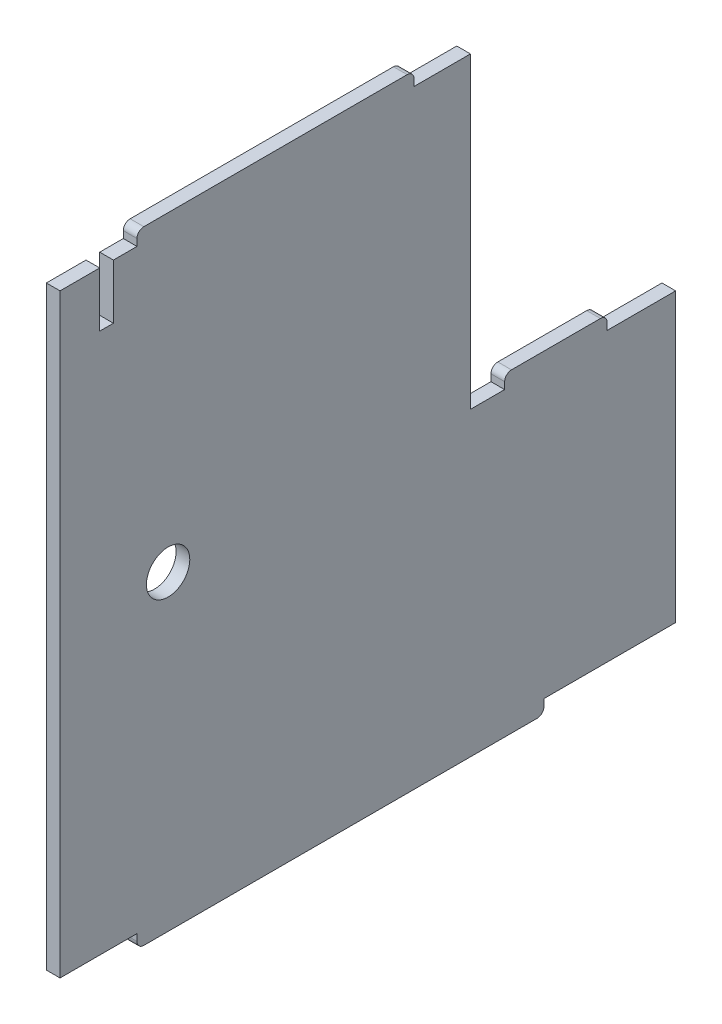
ISO-10303-21;
HEADER;
FILE_DESCRIPTION(('STEP AP214'),'2;1');
FILE_NAME('part.step','',(''),(''),'','','');
FILE_SCHEMA(('AUTOMOTIVE_DESIGN { 1 0 10303 214 1 1 1 1 }'));
ENDSEC;
DATA;
#1=APPLICATION_CONTEXT('core data for automotive mechanical design processes');
#2=APPLICATION_PROTOCOL_DEFINITION('international standard','automotive_design',2000,#1);
#3=PRODUCT_CONTEXT('',#1,'mechanical');
#4=PRODUCT('Part','Part','',(#3));
#5=PRODUCT_RELATED_PRODUCT_CATEGORY('part','',(#4));
#6=PRODUCT_DEFINITION_FORMATION('','',#4);
#7=PRODUCT_DEFINITION_CONTEXT('part definition',#1,'design');
#8=PRODUCT_DEFINITION('design','',#6,#7);
#9=PRODUCT_DEFINITION_SHAPE('','',#8);
#10=(LENGTH_UNIT() NAMED_UNIT(*) SI_UNIT(.MILLI.,.METRE.));
#11=(NAMED_UNIT(*) PLANE_ANGLE_UNIT() SI_UNIT($,.RADIAN.));
#12=(NAMED_UNIT(*) SI_UNIT($,.STERADIAN.) SOLID_ANGLE_UNIT());
#13=UNCERTAINTY_MEASURE_WITH_UNIT(LENGTH_MEASURE(1.E-05),#10,'distance_accuracy_value','');
#14=(GEOMETRIC_REPRESENTATION_CONTEXT(3) GLOBAL_UNCERTAINTY_ASSIGNED_CONTEXT((#13)) GLOBAL_UNIT_ASSIGNED_CONTEXT((#10,
#11,#12)) REPRESENTATION_CONTEXT('',''));
#15=CARTESIAN_POINT('',(0.,0.,0.));
#16=DIRECTION('',(0.,0.,1.));
#17=DIRECTION('',(1.,0.,0.));
#18=AXIS2_PLACEMENT_3D('',#15,#16,#17);
#19=CARTESIAN_POINT('',(2.,-21.2437855155228,-20.7523835906544));
#20=DIRECTION('',(-1.,0.,0.));
#21=DIRECTION('',(0.,0.,1.));
#22=AXIS2_PLACEMENT_3D('',#19,#20,#21);
#23=PLANE('',#22);
#24=DIRECTION('',(0.,0.,1.));
#25=VECTOR('',#24,1.);
#26=CARTESIAN_POINT('',(2.,22.7562144844773,-6.50187471929071));
#27=LINE('',#26,#25);
#28=CARTESIAN_POINT('',(2.,22.7562144844773,-14.7523835906544));
#29=VERTEX_POINT('',#28);
#30=CARTESIAN_POINT('',(2.,22.7562144844773,-6.50187471929071));
#31=VERTEX_POINT('',#30);
#32=EDGE_CURVE('E303',#29,#31,#27,.T.);
#33=ORIENTED_EDGE('',*,*,#32,.T.);
#34=DIRECTION('',(0.,1.,0.));
#35=VECTOR('',#34,1.);
#36=CARTESIAN_POINT('',(2.,22.7562144844773,-6.50187471929071));
#37=LINE('',#36,#35);
#38=CARTESIAN_POINT('',(2.,23.7562144844773,-6.50187471929071));
#39=VERTEX_POINT('',#38);
#40=EDGE_CURVE('E151',#31,#39,#37,.T.);
#41=ORIENTED_EDGE('',*,*,#40,.T.);
#42=CARTESIAN_POINT('',(2.,23.7562144844773,-5.50187471929071));
#43=DIRECTION('',(1.,0.,0.));
#44=DIRECTION('',(0.,0.,-1.));
#45=AXIS2_PLACEMENT_3D('',#42,#43,#44);
#46=CIRCLE('',#45,1.);
#47=CARTESIAN_POINT('',(2.,24.7562144844773,-5.5018747192907));
#48=VERTEX_POINT('',#47);
#49=EDGE_CURVE('E378',#39,#48,#46,.T.);
#50=ORIENTED_EDGE('',*,*,#49,.T.);
#51=DIRECTION('',(0.,0.,1.));
#52=VECTOR('',#51,1.);
#53=CARTESIAN_POINT('',(2.,24.7562144844773,-5.5018747192907));
#54=LINE('',#53,#52);
#55=CARTESIAN_POINT('',(2.,24.7562144844773,32.9971075379794));
#56=VERTEX_POINT('',#55);
#57=EDGE_CURVE('E397',#48,#56,#54,.T.);
#58=ORIENTED_EDGE('',*,*,#57,.T.);
#59=CARTESIAN_POINT('',(2.,23.7562144844773,32.9971075379794));
#60=DIRECTION('',(1.,0.,0.));
#61=DIRECTION('',(0.,0.,1.));
#62=AXIS2_PLACEMENT_3D('',#59,#60,#61);
#63=CIRCLE('',#62,1.);
#64=CARTESIAN_POINT('',(2.,23.7562144844773,33.9971075379794));
#65=VERTEX_POINT('',#64);
#66=EDGE_CURVE('E394',#56,#65,#63,.T.);
#67=ORIENTED_EDGE('',*,*,#66,.T.);
#68=DIRECTION('',(0.,-1.,0.));
#69=VECTOR('',#68,1.);
#70=CARTESIAN_POINT('',(2.,22.7562144844773,33.9971075379794));
#71=LINE('',#70,#69);
#72=CARTESIAN_POINT('',(2.,22.7562144844773,33.9971075379794));
#73=VERTEX_POINT('',#72);
#74=EDGE_CURVE('E396',#65,#73,#71,.T.);
#75=ORIENTED_EDGE('',*,*,#74,.T.);
#76=DIRECTION('',(0.,0.,1.));
#77=VECTOR('',#76,1.);
#78=CARTESIAN_POINT('',(2.,22.7562144844773,37.4476164093443));
#79=LINE('',#78,#77);
#80=CARTESIAN_POINT('',(2.,22.7562144844773,37.4476164093443));
#81=VERTEX_POINT('',#80);
#82=EDGE_CURVE('E399',#73,#81,#79,.T.);
#83=ORIENTED_EDGE('',*,*,#82,.T.);
#84=DIRECTION('',(0.,-1.,0.));
#85=VECTOR('',#84,1.);
#86=CARTESIAN_POINT('',(2.,14.7562144844773,37.4476164093443));
#87=LINE('',#86,#85);
#88=CARTESIAN_POINT('',(2.,14.7562144844773,37.4476164093443));
#89=VERTEX_POINT('',#88);
#90=EDGE_CURVE('E405',#81,#89,#87,.T.);
#91=ORIENTED_EDGE('',*,*,#90,.T.);
#92=DIRECTION('',(0.,0.,1.));
#93=VECTOR('',#92,1.);
#94=CARTESIAN_POINT('',(2.,14.7562144844773,37.4476164093443));
#95=LINE('',#94,#93);
#96=CARTESIAN_POINT('',(2.,14.7562144844773,39.4476164093443));
#97=VERTEX_POINT('',#96);
#98=EDGE_CURVE('E407',#89,#97,#95,.T.);
#99=ORIENTED_EDGE('',*,*,#98,.T.);
#100=DIRECTION('',(0.,1.,0.));
#101=VECTOR('',#100,1.);
#102=CARTESIAN_POINT('',(2.,14.7562144844773,39.4476164093443));
#103=LINE('',#102,#101);
#104=CARTESIAN_POINT('',(2.,22.7562144844773,39.4476164093443));
#105=VERTEX_POINT('',#104);
#106=EDGE_CURVE('E409',#97,#105,#103,.T.);
#107=ORIENTED_EDGE('',*,*,#106,.T.);
#108=DIRECTION('',(0.,0.,1.));
#109=VECTOR('',#108,1.);
#110=CARTESIAN_POINT('',(2.,22.7562144844773,39.4476164093443));
#111=LINE('',#110,#109);
#112=CARTESIAN_POINT('',(2.,22.7562144844773,45.2476164093441));
#113=VERTEX_POINT('',#112);
#114=EDGE_CURVE('E411',#105,#113,#111,.T.);
#115=ORIENTED_EDGE('',*,*,#114,.T.);
#116=DIRECTION('',(0.,-1.,0.));
#117=VECTOR('',#116,1.);
#118=CARTESIAN_POINT('',(2.,-64.2437855155227,45.2476164093441));
#119=LINE('',#118,#117);
#120=CARTESIAN_POINT('',(2.,-64.2437855155227,45.2476164093441));
#121=VERTEX_POINT('',#120);
#122=EDGE_CURVE('E413',#113,#121,#119,.T.);
#123=ORIENTED_EDGE('',*,*,#122,.T.);
#124=DIRECTION('',(0.,0.,-1.));
#125=VECTOR('',#124,1.);
#126=CARTESIAN_POINT('',(2.,-64.2437855155227,45.2476164093441));
#127=LINE('',#126,#125);
#128=CARTESIAN_POINT('',(2.,-64.2437855155227,33.9971075379816));
#129=VERTEX_POINT('',#128);
#130=EDGE_CURVE('E415',#121,#129,#127,.T.);
#131=ORIENTED_EDGE('',*,*,#130,.T.);
#132=DIRECTION('',(0.,-1.,0.));
#133=VECTOR('',#132,1.);
#134=CARTESIAN_POINT('',(2.,-64.2437855155227,33.9971075379816));
#135=LINE('',#134,#133);
#136=CARTESIAN_POINT('',(2.,-65.2437855155227,33.9971075379817));
#137=VERTEX_POINT('',#136);
#138=EDGE_CURVE('E417',#129,#137,#135,.T.);
#139=ORIENTED_EDGE('',*,*,#138,.T.);
#140=CARTESIAN_POINT('',(2.,-65.2437855155227,32.9971075379818));
#141=DIRECTION('',(1.,0.,0.));
#142=DIRECTION('',(0.,0.,1.));
#143=AXIS2_PLACEMENT_3D('',#140,#141,#142);
#144=CIRCLE('',#143,0.999999999999911);
#145=CARTESIAN_POINT('',(2.,-66.2437855155227,32.9971075379816));
#146=VERTEX_POINT('',#145);
#147=EDGE_CURVE('E419',#137,#146,#144,.T.);
#148=ORIENTED_EDGE('',*,*,#147,.T.);
#149=DIRECTION('',(0.,0.,-1.));
#150=VECTOR('',#149,1.);
#151=CARTESIAN_POINT('',(2.,-66.2437855155227,32.9971075379816));
#152=LINE('',#151,#150);
#153=CARTESIAN_POINT('',(2.,-66.2437855155227,-24.5018747192884));
#154=VERTEX_POINT('',#153);
#155=EDGE_CURVE('E421',#146,#154,#152,.T.);
#156=ORIENTED_EDGE('',*,*,#155,.T.);
#157=CARTESIAN_POINT('',(2.,-65.2437855155227,-24.5018747192884));
#158=DIRECTION('',(1.,0.,0.));
#159=DIRECTION('',(0.,0.,-1.));
#160=AXIS2_PLACEMENT_3D('',#157,#158,#159);
#161=CIRCLE('',#160,1.00000000000002);
#162=CARTESIAN_POINT('',(2.,-65.2437855155227,-25.5018747192884));
#163=VERTEX_POINT('',#162);
#164=EDGE_CURVE('E423',#154,#163,#161,.T.);
#165=ORIENTED_EDGE('',*,*,#164,.T.);
#166=DIRECTION('',(0.,1.,0.));
#167=VECTOR('',#166,1.);
#168=CARTESIAN_POINT('',(2.,-64.2437855155228,-25.5018747192884));
#169=LINE('',#168,#167);
#170=CARTESIAN_POINT('',(2.,-64.2437855155228,-25.5018747192884));
#171=VERTEX_POINT('',#170);
#172=EDGE_CURVE('E425',#163,#171,#169,.T.);
#173=ORIENTED_EDGE('',*,*,#172,.T.);
#174=DIRECTION('',(0.,0.,-1.));
#175=VECTOR('',#174,1.);
#176=CARTESIAN_POINT('',(2.,-64.2437855155228,-44.7523835906534));
#177=LINE('',#176,#175);
#178=CARTESIAN_POINT('',(2.,-64.2437855155228,-44.7523835906534));
#179=VERTEX_POINT('',#178);
#180=EDGE_CURVE('E427',#171,#179,#177,.T.);
#181=ORIENTED_EDGE('',*,*,#180,.T.);
#182=DIRECTION('',(0.,1.,0.));
#183=VECTOR('',#182,1.);
#184=CARTESIAN_POINT('',(2.,-64.2437855155228,-44.7523835906534));
#185=LINE('',#184,#183);
#186=CARTESIAN_POINT('',(2.,-22.2437855155228,-44.7523835906533));
#187=VERTEX_POINT('',#186);
#188=EDGE_CURVE('E429',#179,#187,#185,.T.);
#189=ORIENTED_EDGE('',*,*,#188,.T.);
#190=DIRECTION('',(0.,0.,1.));
#191=VECTOR('',#190,1.);
#192=CARTESIAN_POINT('',(2.,-22.2437855155228,-44.7523835906533));
#193=LINE('',#192,#191);
#194=CARTESIAN_POINT('',(2.,-22.2437855155228,-34.7523835906544));
#195=VERTEX_POINT('',#194);
#196=EDGE_CURVE('E431',#187,#195,#193,.T.);
#197=ORIENTED_EDGE('',*,*,#196,.T.);
#198=DIRECTION('',(0.,1.,0.));
#199=VECTOR('',#198,1.);
#200=CARTESIAN_POINT('',(2.,-22.2437855155228,-34.7523835906544));
#201=LINE('',#200,#199);
#202=CARTESIAN_POINT('',(2.,-21.2437855155228,-34.7523835906544));
#203=VERTEX_POINT('',#202);
#204=EDGE_CURVE('E433',#195,#203,#201,.T.);
#205=ORIENTED_EDGE('',*,*,#204,.T.);
#206=CARTESIAN_POINT('',(2.,-21.2437855155228,-33.7523835906544));
#207=DIRECTION('',(1.,0.,0.));
#208=DIRECTION('',(0.,0.,-1.));
#209=AXIS2_PLACEMENT_3D('',#206,#207,#208);
#210=CIRCLE('',#209,1.);
#211=CARTESIAN_POINT('',(2.,-20.2437855155228,-33.7523835906544));
#212=VERTEX_POINT('',#211);
#213=EDGE_CURVE('E435',#203,#212,#210,.T.);
#214=ORIENTED_EDGE('',*,*,#213,.T.);
#215=DIRECTION('',(0.,0.,1.));
#216=VECTOR('',#215,1.);
#217=CARTESIAN_POINT('',(2.,-20.2437855155228,-33.7523835906544));
#218=LINE('',#217,#216);
#219=CARTESIAN_POINT('',(2.,-20.2437855155228,-20.7523835906544));
#220=VERTEX_POINT('',#219);
#221=EDGE_CURVE('E437',#212,#220,#218,.T.);
#222=ORIENTED_EDGE('',*,*,#221,.T.);
#223=CARTESIAN_POINT('',(2.,-21.2437855155228,-20.7523835906544));
#224=DIRECTION('',(1.,0.,0.));
#225=DIRECTION('',(0.,0.,1.));
#226=AXIS2_PLACEMENT_3D('',#223,#224,#225);
#227=CIRCLE('',#226,1.);
#228=CARTESIAN_POINT('',(2.,-21.2437855155228,-19.7523835906544));
#229=VERTEX_POINT('',#228);
#230=EDGE_CURVE('E230',#220,#229,#227,.T.);
#231=ORIENTED_EDGE('',*,*,#230,.T.);
#232=DIRECTION('',(0.,-1.,0.));
#233=VECTOR('',#232,1.);
#234=CARTESIAN_POINT('',(2.,-22.2437855155228,-19.7523835906544));
#235=LINE('',#234,#233);
#236=CARTESIAN_POINT('',(2.,-22.2437855155228,-19.7523835906544));
#237=VERTEX_POINT('',#236);
#238=EDGE_CURVE('E224',#229,#237,#235,.T.);
#239=ORIENTED_EDGE('',*,*,#238,.T.);
#240=DIRECTION('',(0.,0.,1.));
#241=VECTOR('',#240,1.);
#242=CARTESIAN_POINT('',(2.,-22.2437855155228,-19.7523835906544));
#243=LINE('',#242,#241);
#244=CARTESIAN_POINT('',(2.,-22.2437855155228,-14.7523835906544));
#245=VERTEX_POINT('',#244);
#246=EDGE_CURVE('E228',#237,#245,#243,.T.);
#247=ORIENTED_EDGE('',*,*,#246,.T.);
#248=DIRECTION('',(0.,1.,0.));
#249=VECTOR('',#248,1.);
#250=CARTESIAN_POINT('',(2.,-22.2437855155228,-14.7523835906544));
#251=LINE('',#250,#249);
#252=EDGE_CURVE('E48',#245,#29,#251,.T.);
#253=ORIENTED_EDGE('',*,*,#252,.T.);
#254=EDGE_LOOP('',(#33,#41,#50,#58,#67,#75,#83,#91,#99,#107,#115,#123,#131,#139,#148,#156,#165,
#173,#181,#189,#197,#205,#214,#222,#231,#239,#247,#253));
#255=FACE_BOUND('',#254,.T.);
#256=CARTESIAN_POINT('',(2.,-20.7437855155227,29.4476164093443));
#257=DIRECTION('',(1.,0.,0.));
#258=DIRECTION('',(0.,0.,-1.));
#259=AXIS2_PLACEMENT_3D('',#256,#257,#258);
#260=CIRCLE('',#259,3.17);
#261=CARTESIAN_POINT('',(2.,-20.7437855155227,26.2776164093443));
#262=VERTEX_POINT('',#261);
#263=EDGE_CURVE('E252',#262,#262,#260,.T.);
#264=ORIENTED_EDGE('',*,*,#263,.F.);
#265=EDGE_LOOP('',(#264));
#266=FACE_BOUND('',#265,.T.);
#267=ADVANCED_FACE('F31',(#255,#266),#23,.F.);
#268=CARTESIAN_POINT('',(0.,-21.2437855155228,-20.7523835906544));
#269=DIRECTION('',(-1.,0.,0.));
#270=DIRECTION('',(0.,0.,1.));
#271=AXIS2_PLACEMENT_3D('',#268,#269,#270);
#272=PLANE('',#271);
#273=DIRECTION('',(0.,0.,1.));
#274=VECTOR('',#273,1.);
#275=CARTESIAN_POINT('',(0.,22.7562144844773,-6.50187471929071));
#276=LINE('',#275,#274);
#277=CARTESIAN_POINT('',(0.,22.7562144844773,-14.7523835906544));
#278=VERTEX_POINT('',#277);
#279=CARTESIAN_POINT('',(0.,22.7562144844773,-6.50187471929071));
#280=VERTEX_POINT('',#279);
#281=EDGE_CURVE('E248',#278,#280,#276,.T.);
#282=ORIENTED_EDGE('',*,*,#281,.F.);
#283=DIRECTION('',(0.,1.,0.));
#284=VECTOR('',#283,1.);
#285=CARTESIAN_POINT('',(0.,-22.2437855155228,-14.7523835906544));
#286=LINE('',#285,#284);
#287=CARTESIAN_POINT('',(0.,-22.2437855155228,-14.7523835906544));
#288=VERTEX_POINT('',#287);
#289=EDGE_CURVE('E143',#288,#278,#286,.T.);
#290=ORIENTED_EDGE('',*,*,#289,.F.);
#291=DIRECTION('',(0.,0.,1.));
#292=VECTOR('',#291,1.);
#293=CARTESIAN_POINT('',(0.,-22.2437855155228,-19.7523835906544));
#294=LINE('',#293,#292);
#295=CARTESIAN_POINT('',(0.,-22.2437855155228,-19.7523835906544));
#296=VERTEX_POINT('',#295);
#297=EDGE_CURVE('E137',#296,#288,#294,.T.);
#298=ORIENTED_EDGE('',*,*,#297,.F.);
#299=DIRECTION('',(0.,-1.,0.));
#300=VECTOR('',#299,1.);
#301=CARTESIAN_POINT('',(0.,-22.2437855155228,-19.7523835906544));
#302=LINE('',#301,#300);
#303=CARTESIAN_POINT('',(0.,-21.2437855155228,-19.7523835906544));
#304=VERTEX_POINT('',#303);
#305=EDGE_CURVE('E238',#304,#296,#302,.T.);
#306=ORIENTED_EDGE('',*,*,#305,.F.);
#307=CARTESIAN_POINT('',(0.,-21.2437855155228,-20.7523835906544));
#308=DIRECTION('',(1.,0.,0.));
#309=DIRECTION('',(0.,0.,1.));
#310=AXIS2_PLACEMENT_3D('',#307,#308,#309);
#311=CIRCLE('',#310,1.);
#312=CARTESIAN_POINT('',(0.,-20.2437855155228,-20.7523835906544));
#313=VERTEX_POINT('',#312);
#314=EDGE_CURVE('E298',#313,#304,#311,.T.);
#315=ORIENTED_EDGE('',*,*,#314,.F.);
#316=DIRECTION('',(0.,0.,1.));
#317=VECTOR('',#316,1.);
#318=CARTESIAN_POINT('',(0.,-20.2437855155228,-33.7523835906544));
#319=LINE('',#318,#317);
#320=CARTESIAN_POINT('',(0.,-20.2437855155228,-33.7523835906544));
#321=VERTEX_POINT('',#320);
#322=EDGE_CURVE('E296',#321,#313,#319,.T.);
#323=ORIENTED_EDGE('',*,*,#322,.F.);
#324=CARTESIAN_POINT('',(0.,-21.2437855155228,-33.7523835906544));
#325=DIRECTION('',(1.,0.,0.));
#326=DIRECTION('',(0.,0.,-1.));
#327=AXIS2_PLACEMENT_3D('',#324,#325,#326);
#328=CIRCLE('',#327,1.);
#329=CARTESIAN_POINT('',(0.,-21.2437855155228,-34.7523835906544));
#330=VERTEX_POINT('',#329);
#331=EDGE_CURVE('E294',#330,#321,#328,.T.);
#332=ORIENTED_EDGE('',*,*,#331,.F.);
#333=DIRECTION('',(0.,1.,0.));
#334=VECTOR('',#333,1.);
#335=CARTESIAN_POINT('',(0.,-22.2437855155228,-34.7523835906544));
#336=LINE('',#335,#334);
#337=CARTESIAN_POINT('',(0.,-22.2437855155228,-34.7523835906544));
#338=VERTEX_POINT('',#337);
#339=EDGE_CURVE('E292',#338,#330,#336,.T.);
#340=ORIENTED_EDGE('',*,*,#339,.F.);
#341=DIRECTION('',(0.,0.,1.));
#342=VECTOR('',#341,1.);
#343=CARTESIAN_POINT('',(0.,-22.2437855155228,-44.7523835906533));
#344=LINE('',#343,#342);
#345=CARTESIAN_POINT('',(0.,-22.2437855155228,-44.7523835906533));
#346=VERTEX_POINT('',#345);
#347=EDGE_CURVE('E290',#346,#338,#344,.T.);
#348=ORIENTED_EDGE('',*,*,#347,.F.);
#349=DIRECTION('',(0.,1.,0.));
#350=VECTOR('',#349,1.);
#351=CARTESIAN_POINT('',(0.,-64.2437855155228,-44.7523835906534));
#352=LINE('',#351,#350);
#353=CARTESIAN_POINT('',(0.,-64.2437855155228,-44.7523835906534));
#354=VERTEX_POINT('',#353);
#355=EDGE_CURVE('E288',#354,#346,#352,.T.);
#356=ORIENTED_EDGE('',*,*,#355,.F.);
#357=DIRECTION('',(0.,0.,-1.));
#358=VECTOR('',#357,1.);
#359=CARTESIAN_POINT('',(0.,-64.2437855155228,-44.7523835906534));
#360=LINE('',#359,#358);
#361=CARTESIAN_POINT('',(0.,-64.2437855155228,-25.5018747192884));
#362=VERTEX_POINT('',#361);
#363=EDGE_CURVE('E286',#362,#354,#360,.T.);
#364=ORIENTED_EDGE('',*,*,#363,.F.);
#365=DIRECTION('',(0.,1.,0.));
#366=VECTOR('',#365,1.);
#367=CARTESIAN_POINT('',(0.,-64.2437855155228,-25.5018747192884));
#368=LINE('',#367,#366);
#369=CARTESIAN_POINT('',(0.,-65.2437855155227,-25.5018747192884));
#370=VERTEX_POINT('',#369);
#371=EDGE_CURVE('E284',#370,#362,#368,.T.);
#372=ORIENTED_EDGE('',*,*,#371,.F.);
#373=CARTESIAN_POINT('',(0.,-65.2437855155227,-24.5018747192884));
#374=DIRECTION('',(1.,0.,0.));
#375=DIRECTION('',(0.,0.,-1.));
#376=AXIS2_PLACEMENT_3D('',#373,#374,#375);
#377=CIRCLE('',#376,1.00000000000002);
#378=CARTESIAN_POINT('',(0.,-66.2437855155227,-24.5018747192884));
#379=VERTEX_POINT('',#378);
#380=EDGE_CURVE('E282',#379,#370,#377,.T.);
#381=ORIENTED_EDGE('',*,*,#380,.F.);
#382=DIRECTION('',(0.,0.,-1.));
#383=VECTOR('',#382,1.);
#384=CARTESIAN_POINT('',(0.,-66.2437855155227,32.9971075379816));
#385=LINE('',#384,#383);
#386=CARTESIAN_POINT('',(0.,-66.2437855155227,32.9971075379816));
#387=VERTEX_POINT('',#386);
#388=EDGE_CURVE('E280',#387,#379,#385,.T.);
#389=ORIENTED_EDGE('',*,*,#388,.F.);
#390=CARTESIAN_POINT('',(0.,-65.2437855155227,32.9971075379818));
#391=DIRECTION('',(1.,0.,0.));
#392=DIRECTION('',(0.,0.,1.));
#393=AXIS2_PLACEMENT_3D('',#390,#391,#392);
#394=CIRCLE('',#393,0.999999999999911);
#395=CARTESIAN_POINT('',(0.,-65.2437855155227,33.9971075379817));
#396=VERTEX_POINT('',#395);
#397=EDGE_CURVE('E278',#396,#387,#394,.T.);
#398=ORIENTED_EDGE('',*,*,#397,.F.);
#399=DIRECTION('',(0.,-1.,0.));
#400=VECTOR('',#399,1.);
#401=CARTESIAN_POINT('',(0.,-64.2437855155227,33.9971075379816));
#402=LINE('',#401,#400);
#403=CARTESIAN_POINT('',(0.,-64.2437855155227,33.9971075379816));
#404=VERTEX_POINT('',#403);
#405=EDGE_CURVE('E276',#404,#396,#402,.T.);
#406=ORIENTED_EDGE('',*,*,#405,.F.);
#407=DIRECTION('',(0.,0.,-1.));
#408=VECTOR('',#407,1.);
#409=CARTESIAN_POINT('',(0.,-64.2437855155227,45.2476164093441));
#410=LINE('',#409,#408);
#411=CARTESIAN_POINT('',(0.,-64.2437855155227,45.2476164093441));
#412=VERTEX_POINT('',#411);
#413=EDGE_CURVE('E274',#412,#404,#410,.T.);
#414=ORIENTED_EDGE('',*,*,#413,.F.);
#415=DIRECTION('',(0.,-1.,0.));
#416=VECTOR('',#415,1.);
#417=CARTESIAN_POINT('',(0.,-64.2437855155227,45.2476164093441));
#418=LINE('',#417,#416);
#419=CARTESIAN_POINT('',(0.,22.7562144844773,45.2476164093441));
#420=VERTEX_POINT('',#419);
#421=EDGE_CURVE('E272',#420,#412,#418,.T.);
#422=ORIENTED_EDGE('',*,*,#421,.F.);
#423=DIRECTION('',(0.,0.,1.));
#424=VECTOR('',#423,1.);
#425=CARTESIAN_POINT('',(0.,22.7562144844773,39.4476164093443));
#426=LINE('',#425,#424);
#427=CARTESIAN_POINT('',(0.,22.7562144844773,39.4476164093443));
#428=VERTEX_POINT('',#427);
#429=EDGE_CURVE('E270',#428,#420,#426,.T.);
#430=ORIENTED_EDGE('',*,*,#429,.F.);
#431=DIRECTION('',(0.,1.,0.));
#432=VECTOR('',#431,1.);
#433=CARTESIAN_POINT('',(0.,14.7562144844773,39.4476164093443));
#434=LINE('',#433,#432);
#435=CARTESIAN_POINT('',(0.,14.7562144844773,39.4476164093443));
#436=VERTEX_POINT('',#435);
#437=EDGE_CURVE('E268',#436,#428,#434,.T.);
#438=ORIENTED_EDGE('',*,*,#437,.F.);
#439=DIRECTION('',(0.,0.,1.));
#440=VECTOR('',#439,1.);
#441=CARTESIAN_POINT('',(0.,14.7562144844773,37.4476164093443));
#442=LINE('',#441,#440);
#443=CARTESIAN_POINT('',(0.,14.7562144844773,37.4476164093443));
#444=VERTEX_POINT('',#443);
#445=EDGE_CURVE('E266',#444,#436,#442,.T.);
#446=ORIENTED_EDGE('',*,*,#445,.F.);
#447=DIRECTION('',(0.,-1.,0.));
#448=VECTOR('',#447,1.);
#449=CARTESIAN_POINT('',(0.,14.7562144844773,37.4476164093443));
#450=LINE('',#449,#448);
#451=CARTESIAN_POINT('',(0.,22.7562144844773,37.4476164093443));
#452=VERTEX_POINT('',#451);
#453=EDGE_CURVE('E264',#452,#444,#450,.T.);
#454=ORIENTED_EDGE('',*,*,#453,.F.);
#455=DIRECTION('',(0.,0.,1.));
#456=VECTOR('',#455,1.);
#457=CARTESIAN_POINT('',(0.,22.7562144844773,37.4476164093443));
#458=LINE('',#457,#456);
#459=CARTESIAN_POINT('',(0.,22.7562144844773,33.9971075379794));
#460=VERTEX_POINT('',#459);
#461=EDGE_CURVE('E262',#460,#452,#458,.T.);
#462=ORIENTED_EDGE('',*,*,#461,.F.);
#463=DIRECTION('',(0.,-1.,0.));
#464=VECTOR('',#463,1.);
#465=CARTESIAN_POINT('',(0.,22.7562144844773,33.9971075379794));
#466=LINE('',#465,#464);
#467=CARTESIAN_POINT('',(0.,23.7562144844773,33.9971075379794));
#468=VERTEX_POINT('',#467);
#469=EDGE_CURVE('E260',#468,#460,#466,.T.);
#470=ORIENTED_EDGE('',*,*,#469,.F.);
#471=CARTESIAN_POINT('',(0.,23.7562144844773,32.9971075379794));
#472=DIRECTION('',(1.,0.,0.));
#473=DIRECTION('',(0.,0.,1.));
#474=AXIS2_PLACEMENT_3D('',#471,#472,#473);
#475=CIRCLE('',#474,1.);
#476=CARTESIAN_POINT('',(0.,24.7562144844773,32.9971075379794));
#477=VERTEX_POINT('',#476);
#478=EDGE_CURVE('E258',#477,#468,#475,.T.);
#479=ORIENTED_EDGE('',*,*,#478,.F.);
#480=DIRECTION('',(0.,0.,1.));
#481=VECTOR('',#480,1.);
#482=CARTESIAN_POINT('',(0.,24.7562144844773,-5.5018747192907));
#483=LINE('',#482,#481);
#484=CARTESIAN_POINT('',(0.,24.7562144844773,-5.5018747192907));
#485=VERTEX_POINT('',#484);
#486=EDGE_CURVE('E256',#485,#477,#483,.T.);
#487=ORIENTED_EDGE('',*,*,#486,.F.);
#488=CARTESIAN_POINT('',(0.,23.7562144844773,-5.50187471929071));
#489=DIRECTION('',(1.,0.,0.));
#490=DIRECTION('',(0.,0.,-1.));
#491=AXIS2_PLACEMENT_3D('',#488,#489,#490);
#492=CIRCLE('',#491,1.);
#493=CARTESIAN_POINT('',(0.,23.7562144844773,-6.50187471929071));
#494=VERTEX_POINT('',#493);
#495=EDGE_CURVE('E254',#494,#485,#492,.T.);
#496=ORIENTED_EDGE('',*,*,#495,.F.);
#497=DIRECTION('',(0.,1.,0.));
#498=VECTOR('',#497,1.);
#499=CARTESIAN_POINT('',(0.,22.7562144844773,-6.50187471929071));
#500=LINE('',#499,#498);
#501=EDGE_CURVE('E251',#280,#494,#500,.T.);
#502=ORIENTED_EDGE('',*,*,#501,.F.);
#503=EDGE_LOOP('',(#282,#290,#298,#306,#315,#323,#332,#340,#348,#356,#364,#372,#381,#389,#398,
#406,#414,#422,#430,#438,#446,#454,#462,#470,#479,#487,#496,#502));
#504=FACE_BOUND('',#503,.T.);
#505=CARTESIAN_POINT('',(0.,-20.7437855155227,29.4476164093443));
#506=DIRECTION('',(1.,0.,0.));
#507=DIRECTION('',(0.,0.,-1.));
#508=AXIS2_PLACEMENT_3D('',#505,#506,#507);
#509=CIRCLE('',#508,3.17);
#510=CARTESIAN_POINT('',(0.,-20.7437855155227,26.2776164093443));
#511=VERTEX_POINT('',#510);
#512=EDGE_CURVE('E792',#511,#511,#509,.T.);
#513=ORIENTED_EDGE('',*,*,#512,.T.);
#514=EDGE_LOOP('',(#513));
#515=FACE_BOUND('',#514,.T.);
#516=ADVANCED_FACE('F382',(#504,#515),#272,.T.);
#517=CARTESIAN_POINT('',(2.,22.7562144844773,-6.50187471929071));
#518=DIRECTION('',(0.,-1.,0.));
#519=DIRECTION('',(0.,0.,-1.));
#520=AXIS2_PLACEMENT_3D('',#517,#518,#519);
#521=PLANE('',#520);
#522=ORIENTED_EDGE('',*,*,#281,.T.);
#523=DIRECTION('',(-1.,0.,0.));
#524=VECTOR('',#523,1.);
#525=CARTESIAN_POINT('',(2.,22.7562144844773,-6.50187471929071));
#526=LINE('',#525,#524);
#527=EDGE_CURVE('E11',#31,#280,#526,.T.);
#528=ORIENTED_EDGE('',*,*,#527,.F.);
#529=ORIENTED_EDGE('',*,*,#32,.F.);
#530=DIRECTION('',(-1.,0.,0.));
#531=VECTOR('',#530,1.);
#532=CARTESIAN_POINT('',(2.,22.7562144844773,-14.7523835906544));
#533=LINE('',#532,#531);
#534=EDGE_CURVE('E244',#29,#278,#533,.T.);
#535=ORIENTED_EDGE('',*,*,#534,.T.);
#536=EDGE_LOOP('',(#522,#528,#529,#535));
#537=FACE_BOUND('',#536,.T.);
#538=ADVANCED_FACE('F33',(#537),#521,.F.);
#539=CARTESIAN_POINT('',(2.,22.7562144844773,-6.50187471929071));
#540=DIRECTION('',(0.,0.,1.));
#541=DIRECTION('',(1.,0.,0.));
#542=AXIS2_PLACEMENT_3D('',#539,#540,#541);
#543=PLANE('',#542);
#544=ORIENTED_EDGE('',*,*,#501,.T.);
#545=DIRECTION('',(-1.,0.,0.));
#546=VECTOR('',#545,1.);
#547=CARTESIAN_POINT('',(2.,23.7562144844773,-6.50187471929071));
#548=LINE('',#547,#546);
#549=EDGE_CURVE('E40',#39,#494,#548,.T.);
#550=ORIENTED_EDGE('',*,*,#549,.F.);
#551=ORIENTED_EDGE('',*,*,#40,.F.);
#552=ORIENTED_EDGE('',*,*,#527,.T.);
#553=EDGE_LOOP('',(#544,#550,#551,#552));
#554=FACE_BOUND('',#553,.T.);
#555=ADVANCED_FACE('F471',(#554),#543,.F.);
#556=CARTESIAN_POINT('',(2.,23.7562144844773,-5.50187471929071));
#557=DIRECTION('',(-1.,0.,0.));
#558=DIRECTION('',(0.,0.,1.));
#559=AXIS2_PLACEMENT_3D('',#556,#557,#558);
#560=CYLINDRICAL_SURFACE('',#559,1.);
#561=ORIENTED_EDGE('',*,*,#495,.T.);
#562=DIRECTION('',(-1.,0.,0.));
#563=VECTOR('',#562,1.);
#564=CARTESIAN_POINT('',(2.,24.7562144844773,-5.5018747192907));
#565=LINE('',#564,#563);
#566=EDGE_CURVE('E370',#48,#485,#565,.T.);
#567=ORIENTED_EDGE('',*,*,#566,.F.);
#568=ORIENTED_EDGE('',*,*,#49,.F.);
#569=ORIENTED_EDGE('',*,*,#549,.T.);
#570=EDGE_LOOP('',(#561,#567,#568,#569));
#571=FACE_BOUND('',#570,.T.);
#572=ADVANCED_FACE('F376',(#571),#560,.T.);
#573=CARTESIAN_POINT('',(2.,24.7562144844773,-5.5018747192907));
#574=DIRECTION('',(0.,-1.,0.));
#575=DIRECTION('',(0.,0.,-1.));
#576=AXIS2_PLACEMENT_3D('',#573,#574,#575);
#577=PLANE('',#576);
#578=ORIENTED_EDGE('',*,*,#486,.T.);
#579=DIRECTION('',(-1.,0.,0.));
#580=VECTOR('',#579,1.);
#581=CARTESIAN_POINT('',(2.,24.7562144844773,32.9971075379794));
#582=LINE('',#581,#580);
#583=EDGE_CURVE('E367',#56,#477,#582,.T.);
#584=ORIENTED_EDGE('',*,*,#583,.F.);
#585=ORIENTED_EDGE('',*,*,#57,.F.);
#586=ORIENTED_EDGE('',*,*,#566,.T.);
#587=EDGE_LOOP('',(#578,#584,#585,#586));
#588=FACE_BOUND('',#587,.T.);
#589=ADVANCED_FACE('F388',(#588),#577,.F.);
#590=CARTESIAN_POINT('',(2.,23.7562144844773,32.9971075379794));
#591=DIRECTION('',(-1.,0.,0.));
#592=DIRECTION('',(0.,0.,1.));
#593=AXIS2_PLACEMENT_3D('',#590,#591,#592);
#594=CYLINDRICAL_SURFACE('',#593,1.);
#595=ORIENTED_EDGE('',*,*,#478,.T.);
#596=DIRECTION('',(-1.,0.,0.));
#597=VECTOR('',#596,1.);
#598=CARTESIAN_POINT('',(2.,23.7562144844773,33.9971075379794));
#599=LINE('',#598,#597);
#600=EDGE_CURVE('E364',#65,#468,#599,.T.);
#601=ORIENTED_EDGE('',*,*,#600,.F.);
#602=ORIENTED_EDGE('',*,*,#66,.F.);
#603=ORIENTED_EDGE('',*,*,#583,.T.);
#604=EDGE_LOOP('',(#595,#601,#602,#603));
#605=FACE_BOUND('',#604,.T.);
#606=ADVANCED_FACE('F392',(#605),#594,.T.);
#607=CARTESIAN_POINT('',(2.,22.7562144844773,33.9971075379794));
#608=DIRECTION('',(0.,0.,-1.));
#609=DIRECTION('',(-1.,0.,0.));
#610=AXIS2_PLACEMENT_3D('',#607,#608,#609);
#611=PLANE('',#610);
#612=ORIENTED_EDGE('',*,*,#469,.T.);
#613=DIRECTION('',(-1.,0.,0.));
#614=VECTOR('',#613,1.);
#615=CARTESIAN_POINT('',(2.,22.7562144844773,33.9971075379794));
#616=LINE('',#615,#614);
#617=EDGE_CURVE('E361',#73,#460,#616,.T.);
#618=ORIENTED_EDGE('',*,*,#617,.F.);
#619=ORIENTED_EDGE('',*,*,#74,.F.);
#620=ORIENTED_EDGE('',*,*,#600,.T.);
#621=EDGE_LOOP('',(#612,#618,#619,#620));
#622=FACE_BOUND('',#621,.T.);
#623=ADVANCED_FACE('F484',(#622),#611,.F.);
#624=CARTESIAN_POINT('',(2.,22.7562144844773,37.4476164093443));
#625=DIRECTION('',(0.,-1.,0.));
#626=DIRECTION('',(0.,0.,-1.));
#627=AXIS2_PLACEMENT_3D('',#624,#625,#626);
#628=PLANE('',#627);
#629=ORIENTED_EDGE('',*,*,#461,.T.);
#630=DIRECTION('',(-1.,0.,0.));
#631=VECTOR('',#630,1.);
#632=CARTESIAN_POINT('',(2.,22.7562144844773,37.4476164093443));
#633=LINE('',#632,#631);
#634=EDGE_CURVE('E358',#81,#452,#633,.T.);
#635=ORIENTED_EDGE('',*,*,#634,.F.);
#636=ORIENTED_EDGE('',*,*,#82,.F.);
#637=ORIENTED_EDGE('',*,*,#617,.T.);
#638=EDGE_LOOP('',(#629,#635,#636,#637));
#639=FACE_BOUND('',#638,.T.);
#640=ADVANCED_FACE('F487',(#639),#628,.F.);
#641=CARTESIAN_POINT('',(2.,14.7562144844773,37.4476164093443));
#642=DIRECTION('',(0.,0.,-1.));
#643=DIRECTION('',(-1.,0.,0.));
#644=AXIS2_PLACEMENT_3D('',#641,#642,#643);
#645=PLANE('',#644);
#646=ORIENTED_EDGE('',*,*,#453,.T.);
#647=DIRECTION('',(-1.,0.,0.));
#648=VECTOR('',#647,1.);
#649=CARTESIAN_POINT('',(2.,14.7562144844773,37.4476164093443));
#650=LINE('',#649,#648);
#651=EDGE_CURVE('E355',#89,#444,#650,.T.);
#652=ORIENTED_EDGE('',*,*,#651,.F.);
#653=ORIENTED_EDGE('',*,*,#90,.F.);
#654=ORIENTED_EDGE('',*,*,#634,.T.);
#655=EDGE_LOOP('',(#646,#652,#653,#654));
#656=FACE_BOUND('',#655,.T.);
#657=ADVANCED_FACE('F491',(#656),#645,.F.);
#658=CARTESIAN_POINT('',(2.,14.7562144844773,37.4476164093443));
#659=DIRECTION('',(0.,-1.,0.));
#660=DIRECTION('',(0.,0.,-1.));
#661=AXIS2_PLACEMENT_3D('',#658,#659,#660);
#662=PLANE('',#661);
#663=ORIENTED_EDGE('',*,*,#445,.T.);
#664=DIRECTION('',(-1.,0.,0.));
#665=VECTOR('',#664,1.);
#666=CARTESIAN_POINT('',(2.,14.7562144844773,39.4476164093443));
#667=LINE('',#666,#665);
#668=EDGE_CURVE('E352',#97,#436,#667,.T.);
#669=ORIENTED_EDGE('',*,*,#668,.F.);
#670=ORIENTED_EDGE('',*,*,#98,.F.);
#671=ORIENTED_EDGE('',*,*,#651,.T.);
#672=EDGE_LOOP('',(#663,#669,#670,#671));
#673=FACE_BOUND('',#672,.T.);
#674=ADVANCED_FACE('F495',(#673),#662,.F.);
#675=CARTESIAN_POINT('',(2.,14.7562144844773,39.4476164093443));
#676=DIRECTION('',(0.,0.,1.));
#677=DIRECTION('',(1.,0.,0.));
#678=AXIS2_PLACEMENT_3D('',#675,#676,#677);
#679=PLANE('',#678);
#680=ORIENTED_EDGE('',*,*,#437,.T.);
#681=DIRECTION('',(-1.,0.,0.));
#682=VECTOR('',#681,1.);
#683=CARTESIAN_POINT('',(2.,22.7562144844773,39.4476164093443));
#684=LINE('',#683,#682);
#685=EDGE_CURVE('E349',#105,#428,#684,.T.);
#686=ORIENTED_EDGE('',*,*,#685,.F.);
#687=ORIENTED_EDGE('',*,*,#106,.F.);
#688=ORIENTED_EDGE('',*,*,#668,.T.);
#689=EDGE_LOOP('',(#680,#686,#687,#688));
#690=FACE_BOUND('',#689,.T.);
#691=ADVANCED_FACE('F499',(#690),#679,.F.);
#692=CARTESIAN_POINT('',(2.,22.7562144844773,39.4476164093443));
#693=DIRECTION('',(0.,-1.,0.));
#694=DIRECTION('',(0.,0.,-1.));
#695=AXIS2_PLACEMENT_3D('',#692,#693,#694);
#696=PLANE('',#695);
#697=ORIENTED_EDGE('',*,*,#429,.T.);
#698=DIRECTION('',(-1.,0.,0.));
#699=VECTOR('',#698,1.);
#700=CARTESIAN_POINT('',(2.,22.7562144844773,45.2476164093441));
#701=LINE('',#700,#699);
#702=EDGE_CURVE('E346',#113,#420,#701,.T.);
#703=ORIENTED_EDGE('',*,*,#702,.F.);
#704=ORIENTED_EDGE('',*,*,#114,.F.);
#705=ORIENTED_EDGE('',*,*,#685,.T.);
#706=EDGE_LOOP('',(#697,#703,#704,#705));
#707=FACE_BOUND('',#706,.T.);
#708=ADVANCED_FACE('F503',(#707),#696,.F.);
#709=CARTESIAN_POINT('',(2.,-64.2437855155227,45.2476164093441));
#710=DIRECTION('',(0.,0.,-1.));
#711=DIRECTION('',(-1.,0.,0.));
#712=AXIS2_PLACEMENT_3D('',#709,#710,#711);
#713=PLANE('',#712);
#714=ORIENTED_EDGE('',*,*,#421,.T.);
#715=DIRECTION('',(-1.,0.,0.));
#716=VECTOR('',#715,1.);
#717=CARTESIAN_POINT('',(2.,-64.2437855155227,45.2476164093441));
#718=LINE('',#717,#716);
#719=EDGE_CURVE('E343',#121,#412,#718,.T.);
#720=ORIENTED_EDGE('',*,*,#719,.F.);
#721=ORIENTED_EDGE('',*,*,#122,.F.);
#722=ORIENTED_EDGE('',*,*,#702,.T.);
#723=EDGE_LOOP('',(#714,#720,#721,#722));
#724=FACE_BOUND('',#723,.T.);
#725=ADVANCED_FACE('F507',(#724),#713,.F.);
#726=CARTESIAN_POINT('',(2.,-64.2437855155227,45.2476164093441));
#727=DIRECTION('',(0.,1.,0.));
#728=DIRECTION('',(0.,0.,1.));
#729=AXIS2_PLACEMENT_3D('',#726,#727,#728);
#730=PLANE('',#729);
#731=ORIENTED_EDGE('',*,*,#413,.T.);
#732=DIRECTION('',(-1.,0.,0.));
#733=VECTOR('',#732,1.);
#734=CARTESIAN_POINT('',(2.,-64.2437855155227,33.9971075379816));
#735=LINE('',#734,#733);
#736=EDGE_CURVE('E340',#129,#404,#735,.T.);
#737=ORIENTED_EDGE('',*,*,#736,.F.);
#738=ORIENTED_EDGE('',*,*,#130,.F.);
#739=ORIENTED_EDGE('',*,*,#719,.T.);
#740=EDGE_LOOP('',(#731,#737,#738,#739));
#741=FACE_BOUND('',#740,.T.);
#742=ADVANCED_FACE('F511',(#741),#730,.F.);
#743=CARTESIAN_POINT('',(2.,-64.2437855155227,33.9971075379816));
#744=DIRECTION('',(0.,0.,-1.));
#745=DIRECTION('',(-1.,0.,0.));
#746=AXIS2_PLACEMENT_3D('',#743,#744,#745);
#747=PLANE('',#746);
#748=ORIENTED_EDGE('',*,*,#405,.T.);
#749=DIRECTION('',(-1.,0.,0.));
#750=VECTOR('',#749,1.);
#751=CARTESIAN_POINT('',(2.,-65.2437855155227,33.9971075379817));
#752=LINE('',#751,#750);
#753=EDGE_CURVE('E337',#137,#396,#752,.T.);
#754=ORIENTED_EDGE('',*,*,#753,.F.);
#755=ORIENTED_EDGE('',*,*,#138,.F.);
#756=ORIENTED_EDGE('',*,*,#736,.T.);
#757=EDGE_LOOP('',(#748,#754,#755,#756));
#758=FACE_BOUND('',#757,.T.);
#759=ADVANCED_FACE('F515',(#758),#747,.F.);
#760=CARTESIAN_POINT('',(2.,-65.2437855155227,32.9971075379818));
#761=DIRECTION('',(-1.,0.,0.));
#762=DIRECTION('',(0.,0.,1.));
#763=AXIS2_PLACEMENT_3D('',#760,#761,#762);
#764=CYLINDRICAL_SURFACE('',#763,0.999999999999911);
#765=ORIENTED_EDGE('',*,*,#397,.T.);
#766=DIRECTION('',(-1.,0.,0.));
#767=VECTOR('',#766,1.);
#768=CARTESIAN_POINT('',(2.,-66.2437855155227,32.9971075379816));
#769=LINE('',#768,#767);
#770=EDGE_CURVE('E334',#146,#387,#769,.T.);
#771=ORIENTED_EDGE('',*,*,#770,.F.);
#772=ORIENTED_EDGE('',*,*,#147,.F.);
#773=ORIENTED_EDGE('',*,*,#753,.T.);
#774=EDGE_LOOP('',(#765,#771,#772,#773));
#775=FACE_BOUND('',#774,.T.);
#776=ADVANCED_FACE('F519',(#775),#764,.T.);
#777=CARTESIAN_POINT('',(2.,-66.2437855155227,32.9971075379816));
#778=DIRECTION('',(0.,1.,0.));
#779=DIRECTION('',(0.,0.,1.));
#780=AXIS2_PLACEMENT_3D('',#777,#778,#779);
#781=PLANE('',#780);
#782=ORIENTED_EDGE('',*,*,#388,.T.);
#783=DIRECTION('',(-1.,0.,0.));
#784=VECTOR('',#783,1.);
#785=CARTESIAN_POINT('',(2.,-66.2437855155227,-24.5018747192884));
#786=LINE('',#785,#784);
#787=EDGE_CURVE('E331',#154,#379,#786,.T.);
#788=ORIENTED_EDGE('',*,*,#787,.F.);
#789=ORIENTED_EDGE('',*,*,#155,.F.);
#790=ORIENTED_EDGE('',*,*,#770,.T.);
#791=EDGE_LOOP('',(#782,#788,#789,#790));
#792=FACE_BOUND('',#791,.T.);
#793=ADVANCED_FACE('F523',(#792),#781,.F.);
#794=CARTESIAN_POINT('',(2.,-65.2437855155227,-24.5018747192884));
#795=DIRECTION('',(-1.,0.,0.));
#796=DIRECTION('',(0.,0.,1.));
#797=AXIS2_PLACEMENT_3D('',#794,#795,#796);
#798=CYLINDRICAL_SURFACE('',#797,1.00000000000002);
#799=ORIENTED_EDGE('',*,*,#380,.T.);
#800=DIRECTION('',(-1.,0.,0.));
#801=VECTOR('',#800,1.);
#802=CARTESIAN_POINT('',(2.,-65.2437855155227,-25.5018747192884));
#803=LINE('',#802,#801);
#804=EDGE_CURVE('E328',#163,#370,#803,.T.);
#805=ORIENTED_EDGE('',*,*,#804,.F.);
#806=ORIENTED_EDGE('',*,*,#164,.F.);
#807=ORIENTED_EDGE('',*,*,#787,.T.);
#808=EDGE_LOOP('',(#799,#805,#806,#807));
#809=FACE_BOUND('',#808,.T.);
#810=ADVANCED_FACE('F527',(#809),#798,.T.);
#811=CARTESIAN_POINT('',(2.,-64.2437855155228,-25.5018747192884));
#812=DIRECTION('',(0.,0.,1.));
#813=DIRECTION('',(1.,0.,0.));
#814=AXIS2_PLACEMENT_3D('',#811,#812,#813);
#815=PLANE('',#814);
#816=ORIENTED_EDGE('',*,*,#371,.T.);
#817=DIRECTION('',(-1.,0.,0.));
#818=VECTOR('',#817,1.);
#819=CARTESIAN_POINT('',(2.,-64.2437855155228,-25.5018747192884));
#820=LINE('',#819,#818);
#821=EDGE_CURVE('E325',#171,#362,#820,.T.);
#822=ORIENTED_EDGE('',*,*,#821,.F.);
#823=ORIENTED_EDGE('',*,*,#172,.F.);
#824=ORIENTED_EDGE('',*,*,#804,.T.);
#825=EDGE_LOOP('',(#816,#822,#823,#824));
#826=FACE_BOUND('',#825,.T.);
#827=ADVANCED_FACE('F531',(#826),#815,.F.);
#828=CARTESIAN_POINT('',(2.,-64.2437855155228,-44.7523835906534));
#829=DIRECTION('',(0.,1.,0.));
#830=DIRECTION('',(0.,0.,1.));
#831=AXIS2_PLACEMENT_3D('',#828,#829,#830);
#832=PLANE('',#831);
#833=ORIENTED_EDGE('',*,*,#363,.T.);
#834=DIRECTION('',(-1.,0.,0.));
#835=VECTOR('',#834,1.);
#836=CARTESIAN_POINT('',(2.,-64.2437855155228,-44.7523835906534));
#837=LINE('',#836,#835);
#838=EDGE_CURVE('E322',#179,#354,#837,.T.);
#839=ORIENTED_EDGE('',*,*,#838,.F.);
#840=ORIENTED_EDGE('',*,*,#180,.F.);
#841=ORIENTED_EDGE('',*,*,#821,.T.);
#842=EDGE_LOOP('',(#833,#839,#840,#841));
#843=FACE_BOUND('',#842,.T.);
#844=ADVANCED_FACE('F535',(#843),#832,.F.);
#845=CARTESIAN_POINT('',(2.,-64.2437855155228,-44.7523835906534));
#846=DIRECTION('',(0.,0.,1.));
#847=DIRECTION('',(0.,-1.,0.));
#848=AXIS2_PLACEMENT_3D('',#845,#846,#847);
#849=PLANE('',#848);
#850=ORIENTED_EDGE('',*,*,#355,.T.);
#851=DIRECTION('',(-1.,0.,0.));
#852=VECTOR('',#851,1.);
#853=CARTESIAN_POINT('',(2.,-22.2437855155228,-44.7523835906533));
#854=LINE('',#853,#852);
#855=EDGE_CURVE('E319',#187,#346,#854,.T.);
#856=ORIENTED_EDGE('',*,*,#855,.F.);
#857=ORIENTED_EDGE('',*,*,#188,.F.);
#858=ORIENTED_EDGE('',*,*,#838,.T.);
#859=EDGE_LOOP('',(#850,#856,#857,#858));
#860=FACE_BOUND('',#859,.T.);
#861=ADVANCED_FACE('F539',(#860),#849,.F.);
#862=CARTESIAN_POINT('',(2.,-22.2437855155228,-44.7523835906533));
#863=DIRECTION('',(0.,-1.,0.));
#864=DIRECTION('',(0.,0.,-1.));
#865=AXIS2_PLACEMENT_3D('',#862,#863,#864);
#866=PLANE('',#865);
#867=ORIENTED_EDGE('',*,*,#347,.T.);
#868=DIRECTION('',(-1.,0.,0.));
#869=VECTOR('',#868,1.);
#870=CARTESIAN_POINT('',(2.,-22.2437855155228,-34.7523835906544));
#871=LINE('',#870,#869);
#872=EDGE_CURVE('E316',#195,#338,#871,.T.);
#873=ORIENTED_EDGE('',*,*,#872,.F.);
#874=ORIENTED_EDGE('',*,*,#196,.F.);
#875=ORIENTED_EDGE('',*,*,#855,.T.);
#876=EDGE_LOOP('',(#867,#873,#874,#875));
#877=FACE_BOUND('',#876,.T.);
#878=ADVANCED_FACE('F543',(#877),#866,.F.);
#879=CARTESIAN_POINT('',(2.,-22.2437855155228,-34.7523835906544));
#880=DIRECTION('',(0.,0.,1.));
#881=DIRECTION('',(1.,0.,0.));
#882=AXIS2_PLACEMENT_3D('',#879,#880,#881);
#883=PLANE('',#882);
#884=ORIENTED_EDGE('',*,*,#339,.T.);
#885=DIRECTION('',(-1.,0.,0.));
#886=VECTOR('',#885,1.);
#887=CARTESIAN_POINT('',(2.,-21.2437855155228,-34.7523835906544));
#888=LINE('',#887,#886);
#889=EDGE_CURVE('E313',#203,#330,#888,.T.);
#890=ORIENTED_EDGE('',*,*,#889,.F.);
#891=ORIENTED_EDGE('',*,*,#204,.F.);
#892=ORIENTED_EDGE('',*,*,#872,.T.);
#893=EDGE_LOOP('',(#884,#890,#891,#892));
#894=FACE_BOUND('',#893,.T.);
#895=ADVANCED_FACE('F547',(#894),#883,.F.);
#896=CARTESIAN_POINT('',(2.,-21.2437855155228,-33.7523835906544));
#897=DIRECTION('',(-1.,0.,0.));
#898=DIRECTION('',(0.,0.,1.));
#899=AXIS2_PLACEMENT_3D('',#896,#897,#898);
#900=CYLINDRICAL_SURFACE('',#899,1.);
#901=ORIENTED_EDGE('',*,*,#331,.T.);
#902=DIRECTION('',(-1.,0.,0.));
#903=VECTOR('',#902,1.);
#904=CARTESIAN_POINT('',(2.,-20.2437855155228,-33.7523835906544));
#905=LINE('',#904,#903);
#906=EDGE_CURVE('E310',#212,#321,#905,.T.);
#907=ORIENTED_EDGE('',*,*,#906,.F.);
#908=ORIENTED_EDGE('',*,*,#213,.F.);
#909=ORIENTED_EDGE('',*,*,#889,.T.);
#910=EDGE_LOOP('',(#901,#907,#908,#909));
#911=FACE_BOUND('',#910,.T.);
#912=ADVANCED_FACE('F551',(#911),#900,.T.);
#913=CARTESIAN_POINT('',(2.,-20.2437855155228,-33.7523835906544));
#914=DIRECTION('',(0.,-1.,0.));
#915=DIRECTION('',(0.,0.,-1.));
#916=AXIS2_PLACEMENT_3D('',#913,#914,#915);
#917=PLANE('',#916);
#918=ORIENTED_EDGE('',*,*,#322,.T.);
#919=DIRECTION('',(-1.,0.,0.));
#920=VECTOR('',#919,1.);
#921=CARTESIAN_POINT('',(2.,-20.2437855155228,-20.7523835906544));
#922=LINE('',#921,#920);
#923=EDGE_CURVE('E307',#220,#313,#922,.T.);
#924=ORIENTED_EDGE('',*,*,#923,.F.);
#925=ORIENTED_EDGE('',*,*,#221,.F.);
#926=ORIENTED_EDGE('',*,*,#906,.T.);
#927=EDGE_LOOP('',(#918,#924,#925,#926));
#928=FACE_BOUND('',#927,.T.);
#929=ADVANCED_FACE('F443',(#928),#917,.F.);
#930=CARTESIAN_POINT('',(2.,-21.2437855155228,-20.7523835906544));
#931=DIRECTION('',(-1.,0.,0.));
#932=DIRECTION('',(0.,0.,1.));
#933=AXIS2_PLACEMENT_3D('',#930,#931,#932);
#934=CYLINDRICAL_SURFACE('',#933,1.);
#935=ORIENTED_EDGE('',*,*,#314,.T.);
#936=DIRECTION('',(-1.,0.,0.));
#937=VECTOR('',#936,1.);
#938=CARTESIAN_POINT('',(2.,-21.2437855155228,-19.7523835906544));
#939=LINE('',#938,#937);
#940=EDGE_CURVE('E239',#229,#304,#939,.T.);
#941=ORIENTED_EDGE('',*,*,#940,.F.);
#942=ORIENTED_EDGE('',*,*,#230,.F.);
#943=ORIENTED_EDGE('',*,*,#923,.T.);
#944=EDGE_LOOP('',(#935,#941,#942,#943));
#945=FACE_BOUND('',#944,.T.);
#946=ADVANCED_FACE('F447',(#945),#934,.T.);
#947=CARTESIAN_POINT('',(2.,-22.2437855155228,-19.7523835906544));
#948=DIRECTION('',(0.,0.,-1.));
#949=DIRECTION('',(-1.,0.,0.));
#950=AXIS2_PLACEMENT_3D('',#947,#948,#949);
#951=PLANE('',#950);
#952=ORIENTED_EDGE('',*,*,#305,.T.);
#953=DIRECTION('',(-1.,0.,0.));
#954=VECTOR('',#953,1.);
#955=CARTESIAN_POINT('',(2.,-22.2437855155228,-19.7523835906544));
#956=LINE('',#955,#954);
#957=EDGE_CURVE('E235',#237,#296,#956,.T.);
#958=ORIENTED_EDGE('',*,*,#957,.F.);
#959=ORIENTED_EDGE('',*,*,#238,.F.);
#960=ORIENTED_EDGE('',*,*,#940,.T.);
#961=EDGE_LOOP('',(#952,#958,#959,#960));
#962=FACE_BOUND('',#961,.T.);
#963=ADVANCED_FACE('F236',(#962),#951,.F.);
#964=CARTESIAN_POINT('',(2.,-22.2437855155228,-19.7523835906544));
#965=DIRECTION('',(0.,-1.,0.));
#966=DIRECTION('',(0.,0.,-1.));
#967=AXIS2_PLACEMENT_3D('',#964,#965,#966);
#968=PLANE('',#967);
#969=ORIENTED_EDGE('',*,*,#297,.T.);
#970=DIRECTION('',(-1.,0.,0.));
#971=VECTOR('',#970,1.);
#972=CARTESIAN_POINT('',(2.,-22.2437855155228,-14.7523835906544));
#973=LINE('',#972,#971);
#974=EDGE_CURVE('E240',#245,#288,#973,.T.);
#975=ORIENTED_EDGE('',*,*,#974,.F.);
#976=ORIENTED_EDGE('',*,*,#246,.F.);
#977=ORIENTED_EDGE('',*,*,#957,.T.);
#978=EDGE_LOOP('',(#969,#975,#976,#977));
#979=FACE_BOUND('',#978,.T.);
#980=ADVANCED_FACE('F242',(#979),#968,.F.);
#981=CARTESIAN_POINT('',(2.,-22.2437855155228,-14.7523835906544));
#982=DIRECTION('',(0.,0.,1.));
#983=DIRECTION('',(1.,0.,0.));
#984=AXIS2_PLACEMENT_3D('',#981,#982,#983);
#985=PLANE('',#984);
#986=ORIENTED_EDGE('',*,*,#289,.T.);
#987=ORIENTED_EDGE('',*,*,#534,.F.);
#988=ORIENTED_EDGE('',*,*,#252,.F.);
#989=ORIENTED_EDGE('',*,*,#974,.T.);
#990=EDGE_LOOP('',(#986,#987,#988,#989));
#991=FACE_BOUND('',#990,.T.);
#992=ADVANCED_FACE('F451',(#991),#985,.F.);
#993=CARTESIAN_POINT('',(2.,-20.7437855155227,29.4476164093443));
#994=DIRECTION('',(-1.,0.,0.));
#995=DIRECTION('',(0.,0.,1.));
#996=AXIS2_PLACEMENT_3D('',#993,#994,#995);
#997=CYLINDRICAL_SURFACE('',#996,3.17);
#998=ORIENTED_EDGE('',*,*,#263,.T.);
#999=EDGE_LOOP('',(#998));
#1000=FACE_BOUND('',#999,.T.);
#1001=ORIENTED_EDGE('',*,*,#512,.F.);
#1002=EDGE_LOOP('',(#1001));
#1003=FACE_BOUND('',#1002,.T.);
#1004=ADVANCED_FACE('F453',(#1000,#1003),#997,.F.);
#1005=CLOSED_SHELL('',(#267,#516,#538,#555,#572,#589,#606,#623,#640,#657,#674,#691,#708,#725,
#742,#759,#776,#793,#810,#827,#844,#861,#878,#895,#912,#929,#946,#963,#980,#992,#1004));
#1006=MANIFOLD_SOLID_BREP('B2',#1005);
#1007=ADVANCED_BREP_SHAPE_REPRESENTATION('',(#18,#1006),#14);
#1008=SHAPE_DEFINITION_REPRESENTATION(#9,#1007);
ENDSEC;
END-ISO-10303-21;
